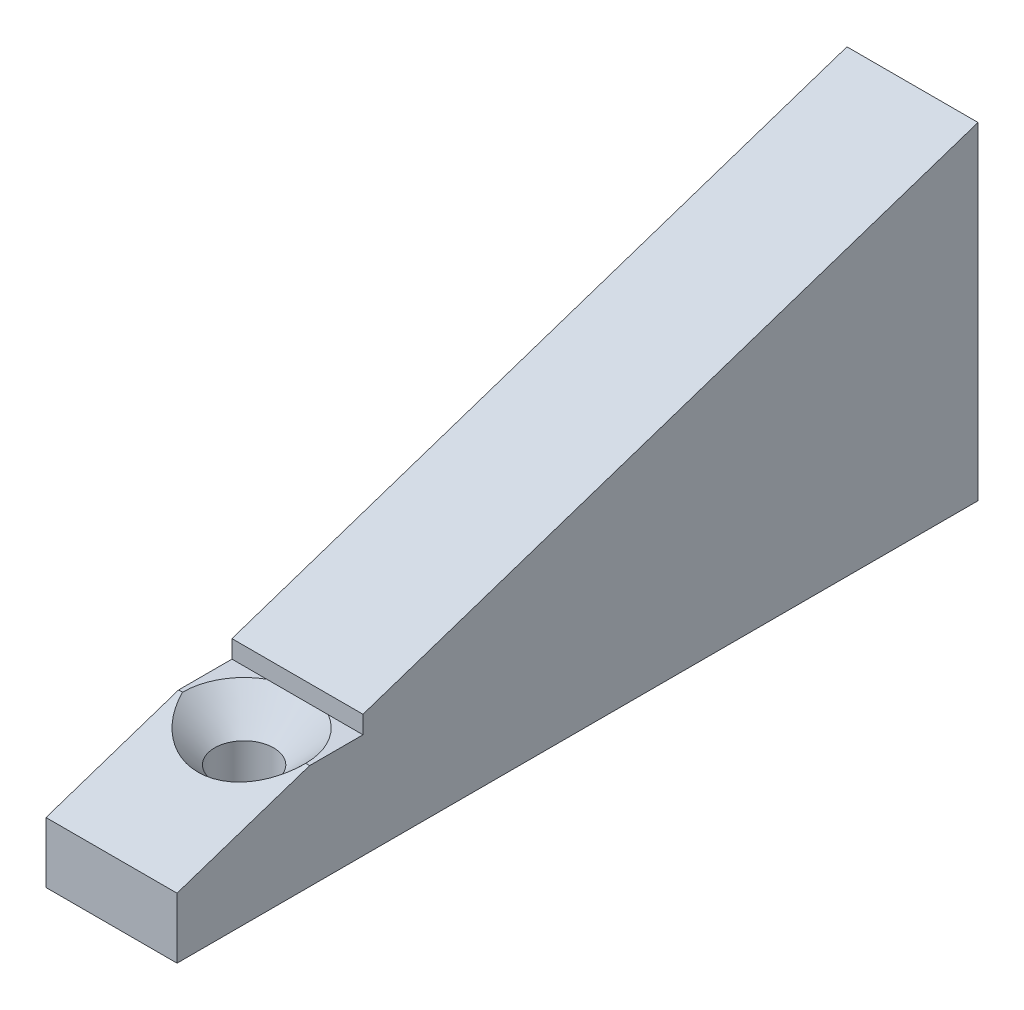
ISO-10303-21;
HEADER;
FILE_DESCRIPTION(('STEP AP214'),'2;1');
FILE_NAME('part.step','',(''),(''),'','','');
FILE_SCHEMA(('AUTOMOTIVE_DESIGN { 1 0 10303 214 1 1 1 1 }'));
ENDSEC;
DATA;
#1=APPLICATION_CONTEXT('core data for automotive mechanical design processes');
#2=APPLICATION_PROTOCOL_DEFINITION('international standard','automotive_design',2000,#1);
#3=PRODUCT_CONTEXT('',#1,'mechanical');
#4=PRODUCT('Part','Part','',(#3));
#5=PRODUCT_RELATED_PRODUCT_CATEGORY('part','',(#4));
#6=PRODUCT_DEFINITION_FORMATION('','',#4);
#7=PRODUCT_DEFINITION_CONTEXT('part definition',#1,'design');
#8=PRODUCT_DEFINITION('design','',#6,#7);
#9=PRODUCT_DEFINITION_SHAPE('','',#8);
#10=(LENGTH_UNIT() NAMED_UNIT(*) SI_UNIT(.MILLI.,.METRE.));
#11=(NAMED_UNIT(*) PLANE_ANGLE_UNIT() SI_UNIT($,.RADIAN.));
#12=(NAMED_UNIT(*) SI_UNIT($,.STERADIAN.) SOLID_ANGLE_UNIT());
#13=UNCERTAINTY_MEASURE_WITH_UNIT(LENGTH_MEASURE(1.E-05),#10,'distance_accuracy_value','');
#14=(GEOMETRIC_REPRESENTATION_CONTEXT(3) GLOBAL_UNCERTAINTY_ASSIGNED_CONTEXT((#13)) GLOBAL_UNIT_ASSIGNED_CONTEXT((#10,
#11,#12)) REPRESENTATION_CONTEXT('',''));
#15=CARTESIAN_POINT('',(0.,0.,0.));
#16=DIRECTION('',(0.,0.,1.));
#17=DIRECTION('',(1.,0.,0.));
#18=AXIS2_PLACEMENT_3D('',#15,#16,#17);
#19=CARTESIAN_POINT('',(10.,7.99999999999999,4.52920587281932));
#20=DIRECTION('',(0.,-1.,0.));
#21=DIRECTION('',(0.,0.,-1.));
#22=AXIS2_PLACEMENT_3D('',#19,#20,#21);
#23=PLANE('',#22);
#24=DIRECTION('',(-1.,0.,0.));
#25=VECTOR('',#24,1.);
#26=CARTESIAN_POINT('',(10.,7.99999999999999,4.52920587281932));
#27=LINE('',#26,#25);
#28=CARTESIAN_POINT('',(10.,7.99999999999999,4.52920587281932));
#29=VERTEX_POINT('',#28);
#30=CARTESIAN_POINT('',(7.3513378027542,7.99999999999999,4.52920587281932));
#31=VERTEX_POINT('',#30);
#32=EDGE_CURVE('E44',#29,#31,#27,.T.);
#33=ORIENTED_EDGE('',*,*,#32,.T.);
#34=CARTESIAN_POINT('',(5.,7.99999999999999,8.59875259663747));
#35=DIRECTION('',(0.,1.,0.));
#36=DIRECTION('',(0.,0.,1.));
#37=AXIS2_PLACEMENT_3D('',#34,#35,#36);
#38=CIRCLE('',#37,4.7);
#39=CARTESIAN_POINT('',(9.7,7.99999999999999,8.59875259663747));
#40=VERTEX_POINT('',#39);
#41=EDGE_CURVE('E191',#40,#31,#38,.T.);
#42=ORIENTED_EDGE('',*,*,#41,.F.);
#43=DIRECTION('',(-1.,0.,0.));
#44=VECTOR('',#43,1.);
#45=CARTESIAN_POINT('',(10.,7.99999999999999,8.59875259663747));
#46=LINE('',#45,#44);
#47=CARTESIAN_POINT('',(10.,7.99999999999999,8.59875259663747));
#48=VERTEX_POINT('',#47);
#49=EDGE_CURVE('E158',#48,#40,#46,.T.);
#50=ORIENTED_EDGE('',*,*,#49,.F.);
#51=DIRECTION('',(0.,0.,1.));
#52=VECTOR('',#51,1.);
#53=CARTESIAN_POINT('',(10.,7.99999999999999,4.52920587281932));
#54=LINE('',#53,#52);
#55=EDGE_CURVE('E197',#29,#48,#54,.T.);
#56=ORIENTED_EDGE('',*,*,#55,.F.);
#57=EDGE_LOOP('',(#33,#42,#50,#56));
#58=FACE_BOUND('',#57,.T.);
#59=ADVANCED_FACE('F35',(#58),#23,.F.);
#60=CARTESIAN_POINT('',(10.,9.35651557460604,4.52920587281932));
#61=DIRECTION('',(0.,-0.948683298050514,-0.316227766016838));
#62=DIRECTION('',(0.,0.316227766016838,-0.948683298050514));
#63=AXIS2_PLACEMENT_3D('',#60,#61,#62);
#64=PLANE('',#63);
#65=DIRECTION('',(0.,-0.316227766016838,0.948683298050514));
#66=VECTOR('',#65,1.);
#67=CARTESIAN_POINT('',(0.,9.35651557460604,4.52920587281932));
#68=LINE('',#67,#66);
#69=CARTESIAN_POINT('',(0.,25.,-42.4012474033625));
#70=VERTEX_POINT('',#69);
#71=CARTESIAN_POINT('',(0.,9.35651557460604,4.52920587281932));
#72=VERTEX_POINT('',#71);
#73=EDGE_CURVE('E138',#70,#72,#68,.T.);
#74=ORIENTED_EDGE('',*,*,#73,.T.);
#75=DIRECTION('',(-1.,0.,0.));
#76=VECTOR('',#75,1.);
#77=CARTESIAN_POINT('',(10.,9.35651557460604,4.52920587281932));
#78=LINE('',#77,#76);
#79=CARTESIAN_POINT('',(10.,9.35651557460604,4.52920587281932));
#80=VERTEX_POINT('',#79);
#81=EDGE_CURVE('E11',#80,#72,#78,.T.);
#82=ORIENTED_EDGE('',*,*,#81,.F.);
#83=DIRECTION('',(0.,-0.316227766016838,0.948683298050514));
#84=VECTOR('',#83,1.);
#85=CARTESIAN_POINT('',(10.,9.35651557460604,4.52920587281932));
#86=LINE('',#85,#84);
#87=CARTESIAN_POINT('',(10.,25.,-42.4012474033625));
#88=VERTEX_POINT('',#87);
#89=EDGE_CURVE('E153',#88,#80,#86,.T.);
#90=ORIENTED_EDGE('',*,*,#89,.F.);
#91=DIRECTION('',(-1.,0.,0.));
#92=VECTOR('',#91,1.);
#93=CARTESIAN_POINT('',(10.,25.,-42.4012474033625));
#94=LINE('',#93,#92);
#95=EDGE_CURVE('E134',#88,#70,#94,.T.);
#96=ORIENTED_EDGE('',*,*,#95,.T.);
#97=EDGE_LOOP('',(#74,#82,#90,#96));
#98=FACE_BOUND('',#97,.T.);
#99=ADVANCED_FACE('F37',(#98),#64,.F.);
#100=CARTESIAN_POINT('',(10.,9.35651557460604,4.52920587281932));
#101=DIRECTION('',(0.,0.,-1.));
#102=DIRECTION('',(0.,1.,0.));
#103=AXIS2_PLACEMENT_3D('',#100,#101,#102);
#104=PLANE('',#103);
#105=DIRECTION('',(0.,-1.,0.));
#106=VECTOR('',#105,1.);
#107=CARTESIAN_POINT('',(0.,9.35651557460604,4.52920587281932));
#108=LINE('',#107,#106);
#109=CARTESIAN_POINT('',(0.,7.99999999999999,4.52920587281932));
#110=VERTEX_POINT('',#109);
#111=EDGE_CURVE('E141',#72,#110,#108,.T.);
#112=ORIENTED_EDGE('',*,*,#111,.T.);
#113=CARTESIAN_POINT('',(2.6486621972458,7.99999999999999,4.52920587281932));
#114=VERTEX_POINT('',#113);
#115=EDGE_CURVE('E161',#114,#110,#27,.T.);
#116=ORIENTED_EDGE('',*,*,#115,.F.);
#117=EDGE_CURVE('E163',#31,#114,#27,.T.);
#118=ORIENTED_EDGE('',*,*,#117,.F.);
#119=ORIENTED_EDGE('',*,*,#32,.F.);
#120=DIRECTION('',(0.,-1.,0.));
#121=VECTOR('',#120,1.);
#122=CARTESIAN_POINT('',(10.,9.35651557460604,4.52920587281932));
#123=LINE('',#122,#121);
#124=EDGE_CURVE('E98',#80,#29,#123,.T.);
#125=ORIENTED_EDGE('',*,*,#124,.F.);
#126=ORIENTED_EDGE('',*,*,#81,.T.);
#127=EDGE_LOOP('',(#112,#116,#118,#119,#125,#126));
#128=FACE_BOUND('',#127,.T.);
#129=ADVANCED_FACE('F176',(#128),#104,.F.);
#130=CARTESIAN_POINT('',(0.3,7.99999999999999,8.59875259663747));
#131=VERTEX_POINT('',#130);
#132=CARTESIAN_POINT('',(0.,7.99999999999999,8.59875259663747));
#133=VERTEX_POINT('',#132);
#134=EDGE_CURVE('E157',#131,#133,#46,.T.);
#135=ORIENTED_EDGE('',*,*,#134,.F.);
#136=EDGE_CURVE('E51',#114,#131,#38,.T.);
#137=ORIENTED_EDGE('',*,*,#136,.F.);
#138=ORIENTED_EDGE('',*,*,#115,.T.);
#139=DIRECTION('',(0.,0.,1.));
#140=VECTOR('',#139,1.);
#141=CARTESIAN_POINT('',(0.,7.99999999999999,4.52920587281932));
#142=LINE('',#141,#140);
#143=EDGE_CURVE('E144',#110,#133,#142,.T.);
#144=ORIENTED_EDGE('',*,*,#143,.T.);
#145=EDGE_LOOP('',(#135,#137,#138,#144));
#146=FACE_BOUND('',#145,.T.);
#147=ADVANCED_FACE('F172',(#146),#23,.F.);
#148=CARTESIAN_POINT('',(10.,4.62678413993646,18.7184001768281));
#149=DIRECTION('',(0.,-0.948683298050514,-0.316227766016838));
#150=DIRECTION('',(0.,0.316227766016838,-0.948683298050514));
#151=AXIS2_PLACEMENT_3D('',#148,#149,#150);
#152=PLANE('',#151);
#153=ORIENTED_EDGE('',*,*,#49,.T.);
#154=CARTESIAN_POINT('',(5.,8.5875,6.83625259663747));
#155=DIRECTION('',(0.,-0.948683298050514,-0.316227766016838));
#156=DIRECTION('',(0.,0.316227766016838,-0.948683298050514));
#157=AXIS2_PLACEMENT_3D('',#154,#155,#156);
#158=ELLIPSE('',#157,5.57351437604677,4.98510280736516);
#159=EDGE_CURVE('E183',#40,#131,#158,.T.);
#160=ORIENTED_EDGE('',*,*,#159,.T.);
#161=ORIENTED_EDGE('',*,*,#134,.T.);
#162=DIRECTION('',(0.,-0.316227766016838,0.948683298050514));
#163=VECTOR('',#162,1.);
#164=CARTESIAN_POINT('',(0.,4.62678413993646,18.7184001768281));
#165=LINE('',#164,#163);
#166=CARTESIAN_POINT('',(0.,4.62678413993646,18.7184001768281));
#167=VERTEX_POINT('',#166);
#168=EDGE_CURVE('E147',#133,#167,#165,.T.);
#169=ORIENTED_EDGE('',*,*,#168,.T.);
#170=DIRECTION('',(-1.,0.,0.));
#171=VECTOR('',#170,1.);
#172=CARTESIAN_POINT('',(10.,4.62678413993646,18.7184001768281));
#173=LINE('',#172,#171);
#174=CARTESIAN_POINT('',(10.,4.62678413993646,18.7184001768281));
#175=VERTEX_POINT('',#174);
#176=EDGE_CURVE('E129',#175,#167,#173,.T.);
#177=ORIENTED_EDGE('',*,*,#176,.F.);
#178=DIRECTION('',(0.,-0.316227766016838,0.948683298050514));
#179=VECTOR('',#178,1.);
#180=CARTESIAN_POINT('',(10.,4.62678413993646,18.7184001768281));
#181=LINE('',#180,#179);
#182=EDGE_CURVE('E117',#48,#175,#181,.T.);
#183=ORIENTED_EDGE('',*,*,#182,.F.);
#184=EDGE_LOOP('',(#153,#160,#161,#169,#177,#183));
#185=FACE_BOUND('',#184,.T.);
#186=ADVANCED_FACE('F182',(#185),#152,.F.);
#187=CARTESIAN_POINT('',(10.,4.62678413993646,18.7184001768281));
#188=DIRECTION('',(0.,0.,-1.));
#189=DIRECTION('',(-1.,0.,0.));
#190=AXIS2_PLACEMENT_3D('',#187,#188,#189);
#191=PLANE('',#190);
#192=DIRECTION('',(0.,-1.,0.));
#193=VECTOR('',#192,1.);
#194=CARTESIAN_POINT('',(0.,4.62678413993646,18.7184001768281));
#195=LINE('',#194,#193);
#196=CARTESIAN_POINT('',(0.,0.,18.7184001768281));
#197=VERTEX_POINT('',#196);
#198=EDGE_CURVE('E126',#167,#197,#195,.T.);
#199=ORIENTED_EDGE('',*,*,#198,.T.);
#200=DIRECTION('',(-1.,0.,0.));
#201=VECTOR('',#200,1.);
#202=CARTESIAN_POINT('',(10.,0.,18.7184001768281));
#203=LINE('',#202,#201);
#204=CARTESIAN_POINT('',(10.,0.,18.7184001768281));
#205=VERTEX_POINT('',#204);
#206=EDGE_CURVE('E123',#205,#197,#203,.T.);
#207=ORIENTED_EDGE('',*,*,#206,.F.);
#208=DIRECTION('',(0.,-1.,0.));
#209=VECTOR('',#208,1.);
#210=CARTESIAN_POINT('',(10.,4.62678413993646,18.7184001768281));
#211=LINE('',#210,#209);
#212=EDGE_CURVE('E110',#175,#205,#211,.T.);
#213=ORIENTED_EDGE('',*,*,#212,.F.);
#214=ORIENTED_EDGE('',*,*,#176,.T.);
#215=EDGE_LOOP('',(#199,#207,#213,#214));
#216=FACE_BOUND('',#215,.T.);
#217=ADVANCED_FACE('F124',(#216),#191,.F.);
#218=CARTESIAN_POINT('',(10.,0.,-42.4012474033625));
#219=DIRECTION('',(0.,1.,0.));
#220=DIRECTION('',(0.,0.,1.));
#221=AXIS2_PLACEMENT_3D('',#218,#219,#220);
#222=PLANE('',#221);
#223=CARTESIAN_POINT('',(5.,0.,8.59875259663747));
#224=DIRECTION('',(0.,1.,0.));
#225=DIRECTION('',(0.,0.,1.));
#226=AXIS2_PLACEMENT_3D('',#223,#224,#225);
#227=CIRCLE('',#226,2.24999999999999);
#228=CARTESIAN_POINT('',(5.,0.,10.8487525966375));
#229=VERTEX_POINT('',#228);
#230=EDGE_CURVE('E39',#229,#229,#227,.T.);
#231=ORIENTED_EDGE('',*,*,#230,.T.);
#232=EDGE_LOOP('',(#231));
#233=FACE_BOUND('',#232,.T.);
#234=DIRECTION('',(0.,0.,-1.));
#235=VECTOR('',#234,1.);
#236=CARTESIAN_POINT('',(0.,0.,-42.4012474033625));
#237=LINE('',#236,#235);
#238=CARTESIAN_POINT('',(0.,0.,-42.4012474033625));
#239=VERTEX_POINT('',#238);
#240=EDGE_CURVE('E150',#197,#239,#237,.T.);
#241=ORIENTED_EDGE('',*,*,#240,.T.);
#242=DIRECTION('',(-1.,0.,0.));
#243=VECTOR('',#242,1.);
#244=CARTESIAN_POINT('',(10.,0.,-42.4012474033625));
#245=LINE('',#244,#243);
#246=CARTESIAN_POINT('',(10.,0.,-42.4012474033625));
#247=VERTEX_POINT('',#246);
#248=EDGE_CURVE('E130',#247,#239,#245,.T.);
#249=ORIENTED_EDGE('',*,*,#248,.F.);
#250=DIRECTION('',(0.,0.,-1.));
#251=VECTOR('',#250,1.);
#252=CARTESIAN_POINT('',(10.,0.,-42.4012474033625));
#253=LINE('',#252,#251);
#254=EDGE_CURVE('E114',#205,#247,#253,.T.);
#255=ORIENTED_EDGE('',*,*,#254,.F.);
#256=ORIENTED_EDGE('',*,*,#206,.T.);
#257=EDGE_LOOP('',(#241,#249,#255,#256));
#258=FACE_BOUND('',#257,.T.);
#259=ADVANCED_FACE('F132',(#233,#258),#222,.F.);
#260=CARTESIAN_POINT('',(10.,25.,-42.4012474033625));
#261=DIRECTION('',(0.,0.,1.));
#262=DIRECTION('',(0.,-1.,0.));
#263=AXIS2_PLACEMENT_3D('',#260,#261,#262);
#264=PLANE('',#263);
#265=CARTESIAN_POINT('',(5.,18.,-42.4012474033625));
#266=DIRECTION('',(0.,0.,-1.));
#267=DIRECTION('',(0.,1.,0.));
#268=AXIS2_PLACEMENT_3D('',#265,#266,#267);
#269=CIRCLE('',#268,2.);
#270=CARTESIAN_POINT('',(5.,20.,-42.4012474033625));
#271=VERTEX_POINT('',#270);
#272=EDGE_CURVE('E213',#271,#271,#269,.T.);
#273=ORIENTED_EDGE('',*,*,#272,.F.);
#274=EDGE_LOOP('',(#273));
#275=FACE_BOUND('',#274,.T.);
#276=CARTESIAN_POINT('',(5.,7.,-42.4012474033625));
#277=DIRECTION('',(0.,0.,-1.));
#278=DIRECTION('',(0.,1.,0.));
#279=AXIS2_PLACEMENT_3D('',#276,#277,#278);
#280=CIRCLE('',#279,2.);
#281=CARTESIAN_POINT('',(5.,9.,-42.4012474033625));
#282=VERTEX_POINT('',#281);
#283=EDGE_CURVE('E204',#282,#282,#280,.T.);
#284=ORIENTED_EDGE('',*,*,#283,.F.);
#285=EDGE_LOOP('',(#284));
#286=FACE_BOUND('',#285,.T.);
#287=DIRECTION('',(0.,1.,0.));
#288=VECTOR('',#287,1.);
#289=CARTESIAN_POINT('',(0.,25.,-42.4012474033625));
#290=LINE('',#289,#288);
#291=EDGE_CURVE('E90',#239,#70,#290,.T.);
#292=ORIENTED_EDGE('',*,*,#291,.T.);
#293=ORIENTED_EDGE('',*,*,#95,.F.);
#294=DIRECTION('',(0.,1.,0.));
#295=VECTOR('',#294,1.);
#296=CARTESIAN_POINT('',(10.,25.,-42.4012474033625));
#297=LINE('',#296,#295);
#298=EDGE_CURVE('E60',#247,#88,#297,.T.);
#299=ORIENTED_EDGE('',*,*,#298,.F.);
#300=ORIENTED_EDGE('',*,*,#248,.T.);
#301=EDGE_LOOP('',(#292,#293,#299,#300));
#302=FACE_BOUND('',#301,.T.);
#303=ADVANCED_FACE('F219',(#275,#286,#302),#264,.F.);
#304=CARTESIAN_POINT('',(10.,0.,0.));
#305=DIRECTION('',(-1.,0.,0.));
#306=DIRECTION('',(0.,0.,1.));
#307=AXIS2_PLACEMENT_3D('',#304,#305,#306);
#308=PLANE('',#307);
#309=ORIENTED_EDGE('',*,*,#89,.T.);
#310=ORIENTED_EDGE('',*,*,#124,.T.);
#311=ORIENTED_EDGE('',*,*,#55,.T.);
#312=ORIENTED_EDGE('',*,*,#182,.T.);
#313=ORIENTED_EDGE('',*,*,#212,.T.);
#314=ORIENTED_EDGE('',*,*,#254,.T.);
#315=ORIENTED_EDGE('',*,*,#298,.T.);
#316=EDGE_LOOP('',(#309,#310,#311,#312,#313,#314,#315));
#317=FACE_BOUND('',#316,.T.);
#318=ADVANCED_FACE('F112',(#317),#308,.F.);
#319=CARTESIAN_POINT('',(0.,0.,0.));
#320=DIRECTION('',(-1.,0.,0.));
#321=DIRECTION('',(0.,0.,1.));
#322=AXIS2_PLACEMENT_3D('',#319,#320,#321);
#323=PLANE('',#322);
#324=ORIENTED_EDGE('',*,*,#73,.F.);
#325=ORIENTED_EDGE('',*,*,#291,.F.);
#326=ORIENTED_EDGE('',*,*,#240,.F.);
#327=ORIENTED_EDGE('',*,*,#198,.F.);
#328=ORIENTED_EDGE('',*,*,#168,.F.);
#329=ORIENTED_EDGE('',*,*,#143,.F.);
#330=ORIENTED_EDGE('',*,*,#111,.F.);
#331=EDGE_LOOP('',(#324,#325,#326,#327,#328,#329,#330));
#332=FACE_BOUND('',#331,.T.);
#333=ADVANCED_FACE('F180',(#332),#323,.T.);
#334=CARTESIAN_POINT('',(9.7,7.99999999999999,8.59875259663747));
#335=DIRECTION('',(0.,1.,0.));
#336=DIRECTION('',(0.,0.,1.));
#337=AXIS2_PLACEMENT_3D('',#334,#335,#336);
#338=PLANE('',#337);
#339=EDGE_CURVE('E200',#31,#114,#38,.T.);
#340=ORIENTED_EDGE('',*,*,#339,.F.);
#341=ORIENTED_EDGE('',*,*,#117,.T.);
#342=EDGE_LOOP('',(#340,#341));
#343=FACE_BOUND('',#342,.T.);
#344=ADVANCED_FACE('F286',(#343),#338,.F.);
#345=CARTESIAN_POINT('',(5.,7.99999999999999,8.59875259663747));
#346=DIRECTION('',(0.,1.,0.));
#347=DIRECTION('',(0.,0.,1.));
#348=AXIS2_PLACEMENT_3D('',#345,#346,#347);
#349=CYLINDRICAL_SURFACE('',#348,2.24999999999999);
#350=CARTESIAN_POINT('',(5.,5.54999999999998,8.59875259663747));
#351=DIRECTION('',(0.,1.,0.));
#352=DIRECTION('',(0.,0.,1.));
#353=AXIS2_PLACEMENT_3D('',#350,#351,#352);
#354=CIRCLE('',#353,2.24999999999999);
#355=CARTESIAN_POINT('',(5.,5.54999999999998,10.8487525966375));
#356=VERTEX_POINT('',#355);
#357=EDGE_CURVE('E187',#356,#356,#354,.T.);
#358=ORIENTED_EDGE('',*,*,#357,.T.);
#359=EDGE_LOOP('',(#358));
#360=FACE_BOUND('',#359,.T.);
#361=ORIENTED_EDGE('',*,*,#230,.F.);
#362=EDGE_LOOP('',(#361));
#363=FACE_BOUND('',#362,.T.);
#364=ADVANCED_FACE('F301',(#360,#363),#349,.F.);
#365=CARTESIAN_POINT('',(5.,7.99999999999999,8.59875259663747));
#366=DIRECTION('',(0.,1.,0.));
#367=DIRECTION('',(0.,0.,1.));
#368=AXIS2_PLACEMENT_3D('',#365,#366,#367);
#369=CONICAL_SURFACE('',#368,4.7,0.785398163397449);
#370=ORIENTED_EDGE('',*,*,#357,.F.);
#371=EDGE_LOOP('',(#370));
#372=FACE_BOUND('',#371,.T.);
#373=ORIENTED_EDGE('',*,*,#41,.T.);
#374=ORIENTED_EDGE('',*,*,#339,.T.);
#375=ORIENTED_EDGE('',*,*,#136,.T.);
#376=ORIENTED_EDGE('',*,*,#159,.F.);
#377=EDGE_LOOP('',(#373,#374,#375,#376));
#378=FACE_BOUND('',#377,.T.);
#379=ADVANCED_FACE('F237',(#372,#378),#369,.F.);
#380=CARTESIAN_POINT('',(5.,7.,-32.4012474033625));
#381=DIRECTION('',(0.,0.,-1.));
#382=DIRECTION('',(0.,1.,0.));
#383=AXIS2_PLACEMENT_3D('',#380,#381,#382);
#384=CONICAL_SURFACE('',#383,2.,1.02974425867665);
#385=CARTESIAN_POINT('',(5.,7.,-31.1995261653074));
#386=VERTEX_POINT('',#385);
#387=VERTEX_LOOP('',#386);
#388=FACE_BOUND('',#387,.T.);
#389=CARTESIAN_POINT('',(5.,7.,-32.4012474033625));
#390=DIRECTION('',(0.,0.,-1.));
#391=DIRECTION('',(0.,1.,0.));
#392=AXIS2_PLACEMENT_3D('',#389,#390,#391);
#393=CIRCLE('',#392,2.);
#394=CARTESIAN_POINT('',(5.,9.,-32.4012474033625));
#395=VERTEX_POINT('',#394);
#396=EDGE_CURVE('E202',#395,#395,#393,.T.);
#397=ORIENTED_EDGE('',*,*,#396,.T.);
#398=EDGE_LOOP('',(#397));
#399=FACE_BOUND('',#398,.T.);
#400=ADVANCED_FACE('F228',(#388,#399),#384,.F.);
#401=CARTESIAN_POINT('',(5.,7.,-42.4012474033625));
#402=DIRECTION('',(0.,0.,-1.));
#403=DIRECTION('',(0.,1.,0.));
#404=AXIS2_PLACEMENT_3D('',#401,#402,#403);
#405=CYLINDRICAL_SURFACE('',#404,2.);
#406=ORIENTED_EDGE('',*,*,#396,.F.);
#407=EDGE_LOOP('',(#406));
#408=FACE_BOUND('',#407,.T.);
#409=ORIENTED_EDGE('',*,*,#283,.T.);
#410=EDGE_LOOP('',(#409));
#411=FACE_BOUND('',#410,.T.);
#412=ADVANCED_FACE('F225',(#408,#411),#405,.F.);
#413=CARTESIAN_POINT('',(5.,18.,-32.4012474033625));
#414=DIRECTION('',(0.,0.,-1.));
#415=DIRECTION('',(0.,1.,0.));
#416=AXIS2_PLACEMENT_3D('',#413,#414,#415);
#417=CONICAL_SURFACE('',#416,2.,1.02974425867665);
#418=CARTESIAN_POINT('',(5.,18.,-31.1995261653074));
#419=VERTEX_POINT('',#418);
#420=VERTEX_LOOP('',#419);
#421=FACE_BOUND('',#420,.T.);
#422=CARTESIAN_POINT('',(5.,18.,-32.4012474033625));
#423=DIRECTION('',(0.,0.,-1.));
#424=DIRECTION('',(0.,1.,0.));
#425=AXIS2_PLACEMENT_3D('',#422,#423,#424);
#426=CIRCLE('',#425,2.);
#427=CARTESIAN_POINT('',(5.,20.,-32.4012474033625));
#428=VERTEX_POINT('',#427);
#429=EDGE_CURVE('E208',#428,#428,#426,.T.);
#430=ORIENTED_EDGE('',*,*,#429,.T.);
#431=EDGE_LOOP('',(#430));
#432=FACE_BOUND('',#431,.T.);
#433=ADVANCED_FACE('F227',(#421,#432),#417,.F.);
#434=CARTESIAN_POINT('',(5.,18.,-42.4012474033625));
#435=DIRECTION('',(0.,0.,-1.));
#436=DIRECTION('',(0.,1.,0.));
#437=AXIS2_PLACEMENT_3D('',#434,#435,#436);
#438=CYLINDRICAL_SURFACE('',#437,2.);
#439=ORIENTED_EDGE('',*,*,#429,.F.);
#440=EDGE_LOOP('',(#439));
#441=FACE_BOUND('',#440,.T.);
#442=ORIENTED_EDGE('',*,*,#272,.T.);
#443=EDGE_LOOP('',(#442));
#444=FACE_BOUND('',#443,.T.);
#445=ADVANCED_FACE('F217',(#441,#444),#438,.F.);
#446=CLOSED_SHELL('',(#59,#99,#129,#147,#186,#217,#259,#303,#318,#333,#344,#364,#379,#400,#412,
#433,#445));
#447=MANIFOLD_SOLID_BREP('B2',#446);
#448=ADVANCED_BREP_SHAPE_REPRESENTATION('',(#18,#447),#14);
#449=SHAPE_DEFINITION_REPRESENTATION(#9,#448);
ENDSEC;
END-ISO-10303-21;
